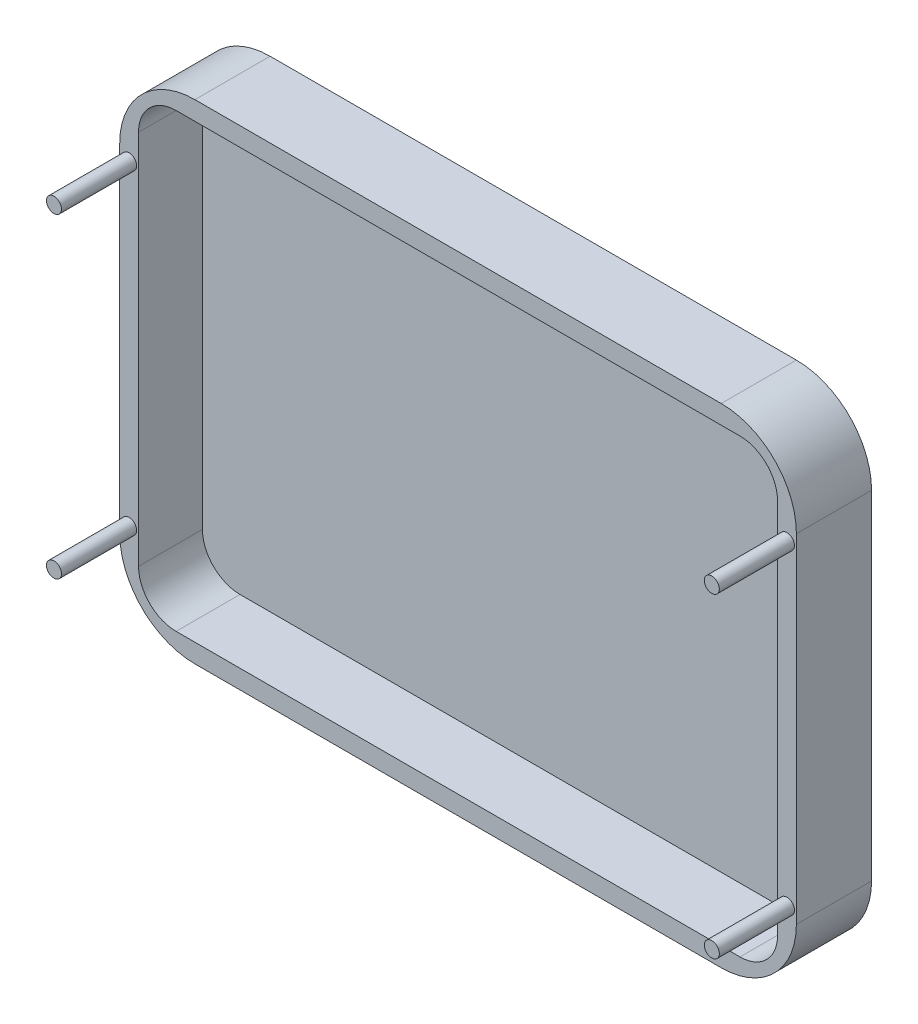
ISO-10303-21;
HEADER;
FILE_DESCRIPTION(('STEP AP214'),'2;1');
FILE_NAME('part.step','',(''),(''),'','','');
FILE_SCHEMA(('AUTOMOTIVE_DESIGN { 1 0 10303 214 1 1 1 1 }'));
ENDSEC;
DATA;
#1=APPLICATION_CONTEXT('core data for automotive mechanical design processes');
#2=APPLICATION_PROTOCOL_DEFINITION('international standard','automotive_design',2000,#1);
#3=PRODUCT_CONTEXT('',#1,'mechanical');
#4=PRODUCT('Part','Part','',(#3));
#5=PRODUCT_RELATED_PRODUCT_CATEGORY('part','',(#4));
#6=PRODUCT_DEFINITION_FORMATION('','',#4);
#7=PRODUCT_DEFINITION_CONTEXT('part definition',#1,'design');
#8=PRODUCT_DEFINITION('design','',#6,#7);
#9=PRODUCT_DEFINITION_SHAPE('','',#8);
#10=(LENGTH_UNIT() NAMED_UNIT(*) SI_UNIT(.MILLI.,.METRE.));
#11=(NAMED_UNIT(*) PLANE_ANGLE_UNIT() SI_UNIT($,.RADIAN.));
#12=(NAMED_UNIT(*) SI_UNIT($,.STERADIAN.) SOLID_ANGLE_UNIT());
#13=UNCERTAINTY_MEASURE_WITH_UNIT(LENGTH_MEASURE(1.E-05),#10,'distance_accuracy_value','');
#14=(GEOMETRIC_REPRESENTATION_CONTEXT(3) GLOBAL_UNCERTAINTY_ASSIGNED_CONTEXT((#13)) GLOBAL_UNIT_ASSIGNED_CONTEXT((#10,
#11,#12)) REPRESENTATION_CONTEXT('',''));
#15=CARTESIAN_POINT('',(0.,0.,0.));
#16=DIRECTION('',(0.,0.,1.));
#17=DIRECTION('',(1.,0.,0.));
#18=AXIS2_PLACEMENT_3D('',#15,#16,#17);
#19=CARTESIAN_POINT('',(75.0444444444444,41.2444444444444,20.));
#20=DIRECTION('',(0.,0.,-1.));
#21=DIRECTION('',(-1.,0.,0.));
#22=AXIS2_PLACEMENT_3D('',#19,#20,#21);
#23=CYLINDRICAL_SURFACE('',#22,20.);
#24=CARTESIAN_POINT('',(75.0444444444444,41.2444444444444,0.));
#25=DIRECTION('',(0.,0.,1.));
#26=DIRECTION('',(-1.,0.,0.));
#27=AXIS2_PLACEMENT_3D('',#24,#25,#26);
#28=CIRCLE('',#27,20.);
#29=CARTESIAN_POINT('',(95.0444444444444,41.2444444444443,0.));
#30=VERTEX_POINT('',#29);
#31=CARTESIAN_POINT('',(75.0444444444443,61.2444444444444,0.));
#32=VERTEX_POINT('',#31);
#33=EDGE_CURVE('E142',#30,#32,#28,.T.);
#34=ORIENTED_EDGE('',*,*,#33,.T.);
#35=DIRECTION('',(0.,0.,-1.));
#36=VECTOR('',#35,1.);
#37=CARTESIAN_POINT('',(75.0444444444443,61.2444444444444,20.));
#38=LINE('',#37,#36);
#39=CARTESIAN_POINT('',(75.0444444444443,61.2444444444444,20.));
#40=VERTEX_POINT('',#39);
#41=EDGE_CURVE('E171',#40,#32,#38,.T.);
#42=ORIENTED_EDGE('',*,*,#41,.F.);
#43=CARTESIAN_POINT('',(75.0444444444444,41.2444444444444,20.));
#44=DIRECTION('',(0.,0.,1.));
#45=DIRECTION('',(-1.,0.,0.));
#46=AXIS2_PLACEMENT_3D('',#43,#44,#45);
#47=CIRCLE('',#46,20.);
#48=CARTESIAN_POINT('',(95.0444444444444,41.2444444444443,20.));
#49=VERTEX_POINT('',#48);
#50=EDGE_CURVE('E158',#49,#40,#47,.T.);
#51=ORIENTED_EDGE('',*,*,#50,.F.);
#52=DIRECTION('',(0.,0.,-1.));
#53=VECTOR('',#52,1.);
#54=CARTESIAN_POINT('',(95.0444444444444,41.2444444444443,20.));
#55=LINE('',#54,#53);
#56=EDGE_CURVE('E138',#49,#30,#55,.T.);
#57=ORIENTED_EDGE('',*,*,#56,.T.);
#58=EDGE_LOOP('',(#34,#42,#51,#57));
#59=FACE_BOUND('',#58,.T.);
#60=ADVANCED_FACE('F33',(#59),#23,.T.);
#61=CARTESIAN_POINT('',(-64.9555555555555,61.2444444444444,20.));
#62=DIRECTION('',(0.,-1.,0.));
#63=DIRECTION('',(1.,0.,0.));
#64=AXIS2_PLACEMENT_3D('',#61,#62,#63);
#65=PLANE('',#64);
#66=DIRECTION('',(-1.,0.,0.));
#67=VECTOR('',#66,1.);
#68=CARTESIAN_POINT('',(-64.9555555555555,61.2444444444444,0.));
#69=LINE('',#68,#67);
#70=CARTESIAN_POINT('',(-64.9555555555555,61.2444444444444,0.));
#71=VERTEX_POINT('',#70);
#72=EDGE_CURVE('E145',#32,#71,#69,.T.);
#73=ORIENTED_EDGE('',*,*,#72,.T.);
#74=DIRECTION('',(0.,0.,-1.));
#75=VECTOR('',#74,1.);
#76=CARTESIAN_POINT('',(-64.9555555555555,61.2444444444444,20.));
#77=LINE('',#76,#75);
#78=CARTESIAN_POINT('',(-64.9555555555555,61.2444444444444,20.));
#79=VERTEX_POINT('',#78);
#80=EDGE_CURVE('E168',#79,#71,#77,.T.);
#81=ORIENTED_EDGE('',*,*,#80,.F.);
#82=DIRECTION('',(-1.,0.,0.));
#83=VECTOR('',#82,1.);
#84=CARTESIAN_POINT('',(-64.9555555555555,61.2444444444444,20.));
#85=LINE('',#84,#83);
#86=EDGE_CURVE('E98',#40,#79,#85,.T.);
#87=ORIENTED_EDGE('',*,*,#86,.F.);
#88=ORIENTED_EDGE('',*,*,#41,.T.);
#89=EDGE_LOOP('',(#73,#81,#87,#88));
#90=FACE_BOUND('',#89,.T.);
#91=ADVANCED_FACE('F268',(#90),#65,.F.);
#92=CARTESIAN_POINT('',(-64.9555555555556,41.2444444444445,20.));
#93=DIRECTION('',(0.,0.,-1.));
#94=DIRECTION('',(-1.,0.,0.));
#95=AXIS2_PLACEMENT_3D('',#92,#93,#94);
#96=CYLINDRICAL_SURFACE('',#95,20.);
#97=CARTESIAN_POINT('',(-64.9555555555556,41.2444444444445,0.));
#98=DIRECTION('',(0.,0.,1.));
#99=DIRECTION('',(1.,0.,0.));
#100=AXIS2_PLACEMENT_3D('',#97,#98,#99);
#101=CIRCLE('',#100,20.);
#102=CARTESIAN_POINT('',(-84.9555555555556,41.2444444444443,0.));
#103=VERTEX_POINT('',#102);
#104=EDGE_CURVE('E148',#71,#103,#101,.T.);
#105=ORIENTED_EDGE('',*,*,#104,.T.);
#106=DIRECTION('',(0.,0.,-1.));
#107=VECTOR('',#106,1.);
#108=CARTESIAN_POINT('',(-84.9555555555556,41.2444444444443,20.));
#109=LINE('',#108,#107);
#110=CARTESIAN_POINT('',(-84.9555555555556,41.2444444444443,20.));
#111=VERTEX_POINT('',#110);
#112=EDGE_CURVE('E165',#111,#103,#109,.T.);
#113=ORIENTED_EDGE('',*,*,#112,.F.);
#114=CARTESIAN_POINT('',(-64.9555555555556,41.2444444444445,20.));
#115=DIRECTION('',(0.,0.,1.));
#116=DIRECTION('',(1.,0.,0.));
#117=AXIS2_PLACEMENT_3D('',#114,#115,#116);
#118=CIRCLE('',#117,20.);
#119=EDGE_CURVE('E250',#79,#111,#118,.T.);
#120=ORIENTED_EDGE('',*,*,#119,.F.);
#121=ORIENTED_EDGE('',*,*,#80,.T.);
#122=EDGE_LOOP('',(#105,#113,#120,#121));
#123=FACE_BOUND('',#122,.T.);
#124=ADVANCED_FACE('F271',(#123),#96,.T.);
#125=CARTESIAN_POINT('',(-84.9555555555556,41.2444444444443,20.));
#126=DIRECTION('',(1.,0.,0.));
#127=DIRECTION('',(0.,1.,0.));
#128=AXIS2_PLACEMENT_3D('',#125,#126,#127);
#129=PLANE('',#128);
#130=DIRECTION('',(0.,-1.,0.));
#131=VECTOR('',#130,1.);
#132=CARTESIAN_POINT('',(-84.9555555555556,41.2444444444443,0.));
#133=LINE('',#132,#131);
#134=CARTESIAN_POINT('',(-84.9555555555556,-48.7555555555554,0.));
#135=VERTEX_POINT('',#134);
#136=EDGE_CURVE('E150',#103,#135,#133,.T.);
#137=ORIENTED_EDGE('',*,*,#136,.T.);
#138=DIRECTION('',(0.,0.,-1.));
#139=VECTOR('',#138,1.);
#140=CARTESIAN_POINT('',(-84.9555555555556,-48.7555555555554,20.));
#141=LINE('',#140,#139);
#142=CARTESIAN_POINT('',(-84.9555555555556,-48.7555555555554,20.));
#143=VERTEX_POINT('',#142);
#144=EDGE_CURVE('E162',#143,#135,#141,.T.);
#145=ORIENTED_EDGE('',*,*,#144,.F.);
#146=DIRECTION('',(0.,-1.,0.));
#147=VECTOR('',#146,1.);
#148=CARTESIAN_POINT('',(-84.9555555555556,41.2444444444443,20.));
#149=LINE('',#148,#147);
#150=EDGE_CURVE('E252',#111,#143,#149,.T.);
#151=ORIENTED_EDGE('',*,*,#150,.F.);
#152=ORIENTED_EDGE('',*,*,#112,.T.);
#153=EDGE_LOOP('',(#137,#145,#151,#152));
#154=FACE_BOUND('',#153,.T.);
#155=ADVANCED_FACE('F258',(#154),#129,.F.);
#156=CARTESIAN_POINT('',(-64.9555555555556,-48.7555555555556,20.));
#157=DIRECTION('',(0.,0.,-1.));
#158=DIRECTION('',(-1.,0.,0.));
#159=AXIS2_PLACEMENT_3D('',#156,#157,#158);
#160=CYLINDRICAL_SURFACE('',#159,20.);
#161=CARTESIAN_POINT('',(-64.9555555555556,-48.7555555555556,0.));
#162=DIRECTION('',(0.,0.,1.));
#163=DIRECTION('',(1.,0.,0.));
#164=AXIS2_PLACEMENT_3D('',#161,#162,#163);
#165=CIRCLE('',#164,20.);
#166=CARTESIAN_POINT('',(-64.9555555555555,-68.7555555555555,0.));
#167=VERTEX_POINT('',#166);
#168=EDGE_CURVE('E152',#135,#167,#165,.T.);
#169=ORIENTED_EDGE('',*,*,#168,.T.);
#170=DIRECTION('',(0.,0.,-1.));
#171=VECTOR('',#170,1.);
#172=CARTESIAN_POINT('',(-64.9555555555555,-68.7555555555555,20.));
#173=LINE('',#172,#171);
#174=CARTESIAN_POINT('',(-64.9555555555555,-68.7555555555555,20.));
#175=VERTEX_POINT('',#174);
#176=EDGE_CURVE('E133',#175,#167,#173,.T.);
#177=ORIENTED_EDGE('',*,*,#176,.F.);
#178=CARTESIAN_POINT('',(-64.9555555555556,-48.7555555555556,20.));
#179=DIRECTION('',(0.,0.,1.));
#180=DIRECTION('',(1.,0.,0.));
#181=AXIS2_PLACEMENT_3D('',#178,#179,#180);
#182=CIRCLE('',#181,20.);
#183=EDGE_CURVE('E121',#143,#175,#182,.T.);
#184=ORIENTED_EDGE('',*,*,#183,.F.);
#185=ORIENTED_EDGE('',*,*,#144,.T.);
#186=EDGE_LOOP('',(#169,#177,#184,#185));
#187=FACE_BOUND('',#186,.T.);
#188=ADVANCED_FACE('F262',(#187),#160,.T.);
#189=CARTESIAN_POINT('',(-64.9555555555554,-68.7555555555556,20.));
#190=DIRECTION('',(0.,1.,0.));
#191=DIRECTION('',(0.,0.,1.));
#192=AXIS2_PLACEMENT_3D('',#189,#190,#191);
#193=PLANE('',#192);
#194=DIRECTION('',(1.,0.,0.));
#195=VECTOR('',#194,1.);
#196=CARTESIAN_POINT('',(-64.9555555555554,-68.7555555555556,0.));
#197=LINE('',#196,#195);
#198=CARTESIAN_POINT('',(75.0444444444443,-68.7555555555556,0.));
#199=VERTEX_POINT('',#198);
#200=EDGE_CURVE('E130',#167,#199,#197,.T.);
#201=ORIENTED_EDGE('',*,*,#200,.T.);
#202=DIRECTION('',(0.,0.,-1.));
#203=VECTOR('',#202,1.);
#204=CARTESIAN_POINT('',(75.0444444444443,-68.7555555555556,20.));
#205=LINE('',#204,#203);
#206=CARTESIAN_POINT('',(75.0444444444443,-68.7555555555556,20.));
#207=VERTEX_POINT('',#206);
#208=EDGE_CURVE('E127',#207,#199,#205,.T.);
#209=ORIENTED_EDGE('',*,*,#208,.F.);
#210=DIRECTION('',(1.,0.,0.));
#211=VECTOR('',#210,1.);
#212=CARTESIAN_POINT('',(-64.9555555555554,-68.7555555555556,20.));
#213=LINE('',#212,#211);
#214=EDGE_CURVE('E114',#175,#207,#213,.T.);
#215=ORIENTED_EDGE('',*,*,#214,.F.);
#216=ORIENTED_EDGE('',*,*,#176,.T.);
#217=EDGE_LOOP('',(#201,#209,#215,#216));
#218=FACE_BOUND('',#217,.T.);
#219=ADVANCED_FACE('F128',(#218),#193,.F.);
#220=CARTESIAN_POINT('',(75.0444444444444,-48.7555555555556,20.));
#221=DIRECTION('',(0.,0.,-1.));
#222=DIRECTION('',(-1.,0.,0.));
#223=AXIS2_PLACEMENT_3D('',#220,#221,#222);
#224=CYLINDRICAL_SURFACE('',#223,20.);
#225=CARTESIAN_POINT('',(75.0444444444444,-48.7555555555556,0.));
#226=DIRECTION('',(0.,0.,1.));
#227=DIRECTION('',(1.,0.,0.));
#228=AXIS2_PLACEMENT_3D('',#225,#226,#227);
#229=CIRCLE('',#228,20.);
#230=CARTESIAN_POINT('',(95.0444444444444,-48.7555555555556,0.));
#231=VERTEX_POINT('',#230);
#232=EDGE_CURVE('E155',#199,#231,#229,.T.);
#233=ORIENTED_EDGE('',*,*,#232,.T.);
#234=DIRECTION('',(0.,0.,-1.));
#235=VECTOR('',#234,1.);
#236=CARTESIAN_POINT('',(95.0444444444444,-48.7555555555556,20.));
#237=LINE('',#236,#235);
#238=CARTESIAN_POINT('',(95.0444444444444,-48.7555555555556,20.));
#239=VERTEX_POINT('',#238);
#240=EDGE_CURVE('E134',#239,#231,#237,.T.);
#241=ORIENTED_EDGE('',*,*,#240,.F.);
#242=CARTESIAN_POINT('',(75.0444444444444,-48.7555555555556,20.));
#243=DIRECTION('',(0.,0.,1.));
#244=DIRECTION('',(1.,0.,0.));
#245=AXIS2_PLACEMENT_3D('',#242,#243,#244);
#246=CIRCLE('',#245,20.);
#247=EDGE_CURVE('E118',#207,#239,#246,.T.);
#248=ORIENTED_EDGE('',*,*,#247,.F.);
#249=ORIENTED_EDGE('',*,*,#208,.T.);
#250=EDGE_LOOP('',(#233,#241,#248,#249));
#251=FACE_BOUND('',#250,.T.);
#252=ADVANCED_FACE('F136',(#251),#224,.T.);
#253=CARTESIAN_POINT('',(95.0444444444444,41.2444444444443,20.));
#254=DIRECTION('',(-1.,0.,0.));
#255=DIRECTION('',(0.,0.,1.));
#256=AXIS2_PLACEMENT_3D('',#253,#254,#255);
#257=PLANE('',#256);
#258=DIRECTION('',(0.,1.,0.));
#259=VECTOR('',#258,1.);
#260=CARTESIAN_POINT('',(95.0444444444444,41.2444444444443,0.));
#261=LINE('',#260,#259);
#262=EDGE_CURVE('E89',#231,#30,#261,.T.);
#263=ORIENTED_EDGE('',*,*,#262,.T.);
#264=ORIENTED_EDGE('',*,*,#56,.F.);
#265=DIRECTION('',(0.,1.,0.));
#266=VECTOR('',#265,1.);
#267=CARTESIAN_POINT('',(95.0444444444444,41.2444444444443,20.));
#268=LINE('',#267,#266);
#269=EDGE_CURVE('E56',#239,#49,#268,.T.);
#270=ORIENTED_EDGE('',*,*,#269,.F.);
#271=ORIENTED_EDGE('',*,*,#240,.T.);
#272=EDGE_LOOP('',(#263,#264,#270,#271));
#273=FACE_BOUND('',#272,.T.);
#274=ADVANCED_FACE('F186',(#273),#257,.F.);
#275=CARTESIAN_POINT('',(75.0444444444444,41.2444444444444,20.));
#276=DIRECTION('',(0.,0.,-1.));
#277=DIRECTION('',(-1.,0.,0.));
#278=AXIS2_PLACEMENT_3D('',#275,#276,#277);
#279=PLANE('',#278);
#280=CARTESIAN_POINT('',(92.5444444444444,38.2444444444444,20.));
#281=DIRECTION('',(0.,0.,-1.));
#282=DIRECTION('',(-1.,0.,0.));
#283=AXIS2_PLACEMENT_3D('',#280,#281,#282);
#284=CIRCLE('',#283,2.);
#285=CARTESIAN_POINT('',(90.5444444444444,38.2444444444444,20.));
#286=VERTEX_POINT('',#285);
#287=EDGE_CURVE('E11',#286,#286,#284,.F.);
#288=ORIENTED_EDGE('',*,*,#287,.F.);
#289=EDGE_LOOP('',(#288));
#290=FACE_BOUND('',#289,.T.);
#291=CARTESIAN_POINT('',(92.5444444444444,-45.7555555555555,20.));
#292=DIRECTION('',(0.,0.,-1.));
#293=DIRECTION('',(-1.,0.,0.));
#294=AXIS2_PLACEMENT_3D('',#291,#292,#293);
#295=CIRCLE('',#294,2.);
#296=CARTESIAN_POINT('',(90.5444444444444,-45.7555555555555,20.));
#297=VERTEX_POINT('',#296);
#298=EDGE_CURVE('E40',#297,#297,#295,.F.);
#299=ORIENTED_EDGE('',*,*,#298,.F.);
#300=EDGE_LOOP('',(#299));
#301=FACE_BOUND('',#300,.T.);
#302=CARTESIAN_POINT('',(-82.4555555555556,-45.7555555555555,20.));
#303=DIRECTION('',(0.,0.,-1.));
#304=DIRECTION('',(-1.,0.,0.));
#305=AXIS2_PLACEMENT_3D('',#302,#303,#304);
#306=CIRCLE('',#305,2.);
#307=CARTESIAN_POINT('',(-84.4555555555556,-45.7555555555555,20.));
#308=VERTEX_POINT('',#307);
#309=EDGE_CURVE('E176',#308,#308,#306,.F.);
#310=ORIENTED_EDGE('',*,*,#309,.F.);
#311=EDGE_LOOP('',(#310));
#312=FACE_BOUND('',#311,.T.);
#313=CARTESIAN_POINT('',(-82.4555555555556,38.2444444444444,20.));
#314=DIRECTION('',(0.,0.,-1.));
#315=DIRECTION('',(-1.,0.,0.));
#316=AXIS2_PLACEMENT_3D('',#313,#314,#315);
#317=CIRCLE('',#316,2.);
#318=CARTESIAN_POINT('',(-84.4555555555556,38.2444444444444,20.));
#319=VERTEX_POINT('',#318);
#320=EDGE_CURVE('E173',#319,#319,#317,.F.);
#321=ORIENTED_EDGE('',*,*,#320,.F.);
#322=EDGE_LOOP('',(#321));
#323=FACE_BOUND('',#322,.T.);
#324=DIRECTION('',(-1.,0.,0.));
#325=VECTOR('',#324,1.);
#326=CARTESIAN_POINT('',(-69.9555555555556,56.2444444444445,20.));
#327=LINE('',#326,#325);
#328=CARTESIAN_POINT('',(80.0444444444444,56.2444444444445,20.));
#329=VERTEX_POINT('',#328);
#330=CARTESIAN_POINT('',(-69.9555555555556,56.2444444444445,20.));
#331=VERTEX_POINT('',#330);
#332=EDGE_CURVE('E196',#329,#331,#327,.T.);
#333=ORIENTED_EDGE('',*,*,#332,.F.);
#334=CARTESIAN_POINT('',(80.0444444444444,46.2444444444445,20.));
#335=DIRECTION('',(0.,0.,1.));
#336=DIRECTION('',(-1.,0.,0.));
#337=AXIS2_PLACEMENT_3D('',#334,#335,#336);
#338=CIRCLE('',#337,9.99999999999999);
#339=CARTESIAN_POINT('',(90.0444444444444,46.2444444444445,20.));
#340=VERTEX_POINT('',#339);
#341=EDGE_CURVE('E47',#340,#329,#338,.T.);
#342=ORIENTED_EDGE('',*,*,#341,.F.);
#343=DIRECTION('',(0.,1.,0.));
#344=VECTOR('',#343,1.);
#345=CARTESIAN_POINT('',(90.0444444444444,46.2444444444445,20.));
#346=LINE('',#345,#344);
#347=CARTESIAN_POINT('',(90.0444444444444,-53.7555555555555,20.));
#348=VERTEX_POINT('',#347);
#349=EDGE_CURVE('E222',#348,#340,#346,.T.);
#350=ORIENTED_EDGE('',*,*,#349,.F.);
#351=CARTESIAN_POINT('',(80.0444444444444,-53.7555555555555,20.));
#352=DIRECTION('',(0.,0.,1.));
#353=DIRECTION('',(1.,0.,0.));
#354=AXIS2_PLACEMENT_3D('',#351,#352,#353);
#355=CIRCLE('',#354,10.);
#356=CARTESIAN_POINT('',(80.0444444444444,-63.7555555555555,20.));
#357=VERTEX_POINT('',#356);
#358=EDGE_CURVE('E219',#357,#348,#355,.T.);
#359=ORIENTED_EDGE('',*,*,#358,.F.);
#360=DIRECTION('',(1.,0.,0.));
#361=VECTOR('',#360,1.);
#362=CARTESIAN_POINT('',(-69.9555555555556,-63.7555555555555,20.));
#363=LINE('',#362,#361);
#364=CARTESIAN_POINT('',(-69.9555555555556,-63.7555555555555,20.));
#365=VERTEX_POINT('',#364);
#366=EDGE_CURVE('E216',#365,#357,#363,.T.);
#367=ORIENTED_EDGE('',*,*,#366,.F.);
#368=CARTESIAN_POINT('',(-69.9555555555556,-53.7555555555555,20.));
#369=DIRECTION('',(0.,0.,1.));
#370=DIRECTION('',(1.,0.,0.));
#371=AXIS2_PLACEMENT_3D('',#368,#369,#370);
#372=CIRCLE('',#371,10.);
#373=CARTESIAN_POINT('',(-79.9555555555556,-53.7555555555555,20.));
#374=VERTEX_POINT('',#373);
#375=EDGE_CURVE('E213',#374,#365,#372,.T.);
#376=ORIENTED_EDGE('',*,*,#375,.F.);
#377=DIRECTION('',(0.,-1.,0.));
#378=VECTOR('',#377,1.);
#379=CARTESIAN_POINT('',(-79.9555555555556,46.2444444444445,20.));
#380=LINE('',#379,#378);
#381=CARTESIAN_POINT('',(-79.9555555555556,46.2444444444445,20.));
#382=VERTEX_POINT('',#381);
#383=EDGE_CURVE('E205',#382,#374,#380,.T.);
#384=ORIENTED_EDGE('',*,*,#383,.F.);
#385=CARTESIAN_POINT('',(-69.9555555555556,46.2444444444445,20.));
#386=DIRECTION('',(0.,0.,1.));
#387=DIRECTION('',(1.,0.,0.));
#388=AXIS2_PLACEMENT_3D('',#385,#386,#387);
#389=CIRCLE('',#388,10.);
#390=EDGE_CURVE('E201',#331,#382,#389,.T.);
#391=ORIENTED_EDGE('',*,*,#390,.F.);
#392=EDGE_LOOP('',(#333,#342,#350,#359,#367,#376,#384,#391));
#393=FACE_BOUND('',#392,.T.);
#394=ORIENTED_EDGE('',*,*,#50,.T.);
#395=ORIENTED_EDGE('',*,*,#86,.T.);
#396=ORIENTED_EDGE('',*,*,#119,.T.);
#397=ORIENTED_EDGE('',*,*,#150,.T.);
#398=ORIENTED_EDGE('',*,*,#183,.T.);
#399=ORIENTED_EDGE('',*,*,#214,.T.);
#400=ORIENTED_EDGE('',*,*,#247,.T.);
#401=ORIENTED_EDGE('',*,*,#269,.T.);
#402=EDGE_LOOP('',(#394,#395,#396,#397,#398,#399,#400,#401));
#403=FACE_BOUND('',#402,.T.);
#404=ADVANCED_FACE('F116',(#290,#301,#312,#323,#393,#403),#279,.F.);
#405=CARTESIAN_POINT('',(75.0444444444444,41.2444444444444,0.));
#406=DIRECTION('',(0.,0.,-1.));
#407=DIRECTION('',(-1.,0.,0.));
#408=AXIS2_PLACEMENT_3D('',#405,#406,#407);
#409=PLANE('',#408);
#410=ORIENTED_EDGE('',*,*,#33,.F.);
#411=ORIENTED_EDGE('',*,*,#262,.F.);
#412=ORIENTED_EDGE('',*,*,#232,.F.);
#413=ORIENTED_EDGE('',*,*,#200,.F.);
#414=ORIENTED_EDGE('',*,*,#168,.F.);
#415=ORIENTED_EDGE('',*,*,#136,.F.);
#416=ORIENTED_EDGE('',*,*,#104,.F.);
#417=ORIENTED_EDGE('',*,*,#72,.F.);
#418=EDGE_LOOP('',(#410,#411,#412,#413,#414,#415,#416,#417));
#419=FACE_BOUND('',#418,.T.);
#420=ADVANCED_FACE('F185',(#419),#409,.T.);
#421=CARTESIAN_POINT('',(80.0444444444444,46.2444444444445,3.));
#422=DIRECTION('',(0.,0.,1.));
#423=DIRECTION('',(1.,0.,0.));
#424=AXIS2_PLACEMENT_3D('',#421,#422,#423);
#425=CYLINDRICAL_SURFACE('',#424,9.99999999999999);
#426=ORIENTED_EDGE('',*,*,#341,.T.);
#427=DIRECTION('',(0.,0.,1.));
#428=VECTOR('',#427,1.);
#429=CARTESIAN_POINT('',(80.0444444444444,56.2444444444445,3.));
#430=LINE('',#429,#428);
#431=CARTESIAN_POINT('',(80.0444444444444,56.2444444444445,3.));
#432=VERTEX_POINT('',#431);
#433=EDGE_CURVE('E245',#432,#329,#430,.T.);
#434=ORIENTED_EDGE('',*,*,#433,.F.);
#435=CARTESIAN_POINT('',(80.0444444444444,46.2444444444445,3.));
#436=DIRECTION('',(0.,0.,1.));
#437=DIRECTION('',(-1.,0.,0.));
#438=AXIS2_PLACEMENT_3D('',#435,#436,#437);
#439=CIRCLE('',#438,9.99999999999999);
#440=CARTESIAN_POINT('',(90.0444444444444,46.2444444444445,3.));
#441=VERTEX_POINT('',#440);
#442=EDGE_CURVE('E225',#441,#432,#439,.T.);
#443=ORIENTED_EDGE('',*,*,#442,.F.);
#444=DIRECTION('',(0.,0.,1.));
#445=VECTOR('',#444,1.);
#446=CARTESIAN_POINT('',(90.0444444444444,46.2444444444445,3.));
#447=LINE('',#446,#445);
#448=EDGE_CURVE('E146',#441,#340,#447,.T.);
#449=ORIENTED_EDGE('',*,*,#448,.T.);
#450=EDGE_LOOP('',(#426,#434,#443,#449));
#451=FACE_BOUND('',#450,.T.);
#452=ADVANCED_FACE('F338',(#451),#425,.F.);
#453=CARTESIAN_POINT('',(90.0444444444444,46.2444444444445,3.));
#454=DIRECTION('',(1.,0.,0.));
#455=DIRECTION('',(0.,0.,-1.));
#456=AXIS2_PLACEMENT_3D('',#453,#454,#455);
#457=PLANE('',#456);
#458=ORIENTED_EDGE('',*,*,#349,.T.);
#459=ORIENTED_EDGE('',*,*,#448,.F.);
#460=DIRECTION('',(0.,1.,0.));
#461=VECTOR('',#460,1.);
#462=CARTESIAN_POINT('',(90.0444444444444,46.2444444444445,3.));
#463=LINE('',#462,#461);
#464=CARTESIAN_POINT('',(90.0444444444444,-53.7555555555555,3.));
#465=VERTEX_POINT('',#464);
#466=EDGE_CURVE('E247',#465,#441,#463,.T.);
#467=ORIENTED_EDGE('',*,*,#466,.F.);
#468=DIRECTION('',(0.,0.,1.));
#469=VECTOR('',#468,1.);
#470=CARTESIAN_POINT('',(90.0444444444444,-53.7555555555555,3.));
#471=LINE('',#470,#469);
#472=EDGE_CURVE('E227',#465,#348,#471,.T.);
#473=ORIENTED_EDGE('',*,*,#472,.T.);
#474=EDGE_LOOP('',(#458,#459,#467,#473));
#475=FACE_BOUND('',#474,.T.);
#476=ADVANCED_FACE('F347',(#475),#457,.F.);
#477=CARTESIAN_POINT('',(80.0444444444444,-53.7555555555555,3.));
#478=DIRECTION('',(0.,0.,1.));
#479=DIRECTION('',(1.,0.,0.));
#480=AXIS2_PLACEMENT_3D('',#477,#478,#479);
#481=CYLINDRICAL_SURFACE('',#480,10.);
#482=ORIENTED_EDGE('',*,*,#358,.T.);
#483=ORIENTED_EDGE('',*,*,#472,.F.);
#484=CARTESIAN_POINT('',(80.0444444444444,-53.7555555555555,3.));
#485=DIRECTION('',(0.,0.,1.));
#486=DIRECTION('',(1.,0.,0.));
#487=AXIS2_PLACEMENT_3D('',#484,#485,#486);
#488=CIRCLE('',#487,10.);
#489=CARTESIAN_POINT('',(80.0444444444444,-63.7555555555555,3.));
#490=VERTEX_POINT('',#489);
#491=EDGE_CURVE('E543',#490,#465,#488,.T.);
#492=ORIENTED_EDGE('',*,*,#491,.F.);
#493=DIRECTION('',(0.,0.,1.));
#494=VECTOR('',#493,1.);
#495=CARTESIAN_POINT('',(80.0444444444444,-63.7555555555555,3.));
#496=LINE('',#495,#494);
#497=EDGE_CURVE('E230',#490,#357,#496,.T.);
#498=ORIENTED_EDGE('',*,*,#497,.T.);
#499=EDGE_LOOP('',(#482,#483,#492,#498));
#500=FACE_BOUND('',#499,.T.);
#501=ADVANCED_FACE('F356',(#500),#481,.F.);
#502=CARTESIAN_POINT('',(-69.9555555555556,-63.7555555555555,3.));
#503=DIRECTION('',(0.,-1.,0.));
#504=DIRECTION('',(0.,0.,-1.));
#505=AXIS2_PLACEMENT_3D('',#502,#503,#504);
#506=PLANE('',#505);
#507=ORIENTED_EDGE('',*,*,#366,.T.);
#508=ORIENTED_EDGE('',*,*,#497,.F.);
#509=DIRECTION('',(1.,0.,0.));
#510=VECTOR('',#509,1.);
#511=CARTESIAN_POINT('',(-69.9555555555556,-63.7555555555555,3.));
#512=LINE('',#511,#510);
#513=CARTESIAN_POINT('',(-69.9555555555556,-63.7555555555555,3.));
#514=VERTEX_POINT('',#513);
#515=EDGE_CURVE('E540',#514,#490,#512,.T.);
#516=ORIENTED_EDGE('',*,*,#515,.F.);
#517=DIRECTION('',(0.,0.,1.));
#518=VECTOR('',#517,1.);
#519=CARTESIAN_POINT('',(-69.9555555555556,-63.7555555555555,3.));
#520=LINE('',#519,#518);
#521=EDGE_CURVE('E233',#514,#365,#520,.T.);
#522=ORIENTED_EDGE('',*,*,#521,.T.);
#523=EDGE_LOOP('',(#507,#508,#516,#522));
#524=FACE_BOUND('',#523,.T.);
#525=ADVANCED_FACE('F366',(#524),#506,.F.);
#526=CARTESIAN_POINT('',(-69.9555555555556,-53.7555555555555,3.));
#527=DIRECTION('',(0.,0.,1.));
#528=DIRECTION('',(1.,0.,0.));
#529=AXIS2_PLACEMENT_3D('',#526,#527,#528);
#530=CYLINDRICAL_SURFACE('',#529,10.);
#531=ORIENTED_EDGE('',*,*,#375,.T.);
#532=ORIENTED_EDGE('',*,*,#521,.F.);
#533=CARTESIAN_POINT('',(-69.9555555555556,-53.7555555555555,3.));
#534=DIRECTION('',(0.,0.,1.));
#535=DIRECTION('',(1.,0.,0.));
#536=AXIS2_PLACEMENT_3D('',#533,#534,#535);
#537=CIRCLE('',#536,10.);
#538=CARTESIAN_POINT('',(-79.9555555555556,-53.7555555555555,3.));
#539=VERTEX_POINT('',#538);
#540=EDGE_CURVE('E537',#539,#514,#537,.T.);
#541=ORIENTED_EDGE('',*,*,#540,.F.);
#542=DIRECTION('',(0.,0.,1.));
#543=VECTOR('',#542,1.);
#544=CARTESIAN_POINT('',(-79.9555555555556,-53.7555555555555,3.));
#545=LINE('',#544,#543);
#546=EDGE_CURVE('E236',#539,#374,#545,.T.);
#547=ORIENTED_EDGE('',*,*,#546,.T.);
#548=EDGE_LOOP('',(#531,#532,#541,#547));
#549=FACE_BOUND('',#548,.T.);
#550=ADVANCED_FACE('F376',(#549),#530,.F.);
#551=CARTESIAN_POINT('',(-79.9555555555556,46.2444444444445,3.));
#552=DIRECTION('',(-1.,0.,0.));
#553=DIRECTION('',(0.,-1.,0.));
#554=AXIS2_PLACEMENT_3D('',#551,#552,#553);
#555=PLANE('',#554);
#556=ORIENTED_EDGE('',*,*,#383,.T.);
#557=ORIENTED_EDGE('',*,*,#546,.F.);
#558=DIRECTION('',(0.,-1.,0.));
#559=VECTOR('',#558,1.);
#560=CARTESIAN_POINT('',(-79.9555555555556,46.2444444444445,3.));
#561=LINE('',#560,#559);
#562=CARTESIAN_POINT('',(-79.9555555555556,46.2444444444445,3.));
#563=VERTEX_POINT('',#562);
#564=EDGE_CURVE('E534',#563,#539,#561,.T.);
#565=ORIENTED_EDGE('',*,*,#564,.F.);
#566=DIRECTION('',(0.,0.,1.));
#567=VECTOR('',#566,1.);
#568=CARTESIAN_POINT('',(-79.9555555555556,46.2444444444445,3.));
#569=LINE('',#568,#567);
#570=EDGE_CURVE('E239',#563,#382,#569,.T.);
#571=ORIENTED_EDGE('',*,*,#570,.T.);
#572=EDGE_LOOP('',(#556,#557,#565,#571));
#573=FACE_BOUND('',#572,.T.);
#574=ADVANCED_FACE('F386',(#573),#555,.F.);
#575=CARTESIAN_POINT('',(-69.9555555555556,46.2444444444445,3.));
#576=DIRECTION('',(0.,0.,1.));
#577=DIRECTION('',(1.,0.,0.));
#578=AXIS2_PLACEMENT_3D('',#575,#576,#577);
#579=CYLINDRICAL_SURFACE('',#578,10.);
#580=ORIENTED_EDGE('',*,*,#390,.T.);
#581=ORIENTED_EDGE('',*,*,#570,.F.);
#582=CARTESIAN_POINT('',(-69.9555555555556,46.2444444444445,3.));
#583=DIRECTION('',(0.,0.,1.));
#584=DIRECTION('',(1.,0.,0.));
#585=AXIS2_PLACEMENT_3D('',#582,#583,#584);
#586=CIRCLE('',#585,10.);
#587=CARTESIAN_POINT('',(-69.9555555555556,56.2444444444445,3.));
#588=VERTEX_POINT('',#587);
#589=EDGE_CURVE('E531',#588,#563,#586,.T.);
#590=ORIENTED_EDGE('',*,*,#589,.F.);
#591=DIRECTION('',(0.,0.,1.));
#592=VECTOR('',#591,1.);
#593=CARTESIAN_POINT('',(-69.9555555555556,56.2444444444445,3.));
#594=LINE('',#593,#592);
#595=EDGE_CURVE('E242',#588,#331,#594,.T.);
#596=ORIENTED_EDGE('',*,*,#595,.T.);
#597=EDGE_LOOP('',(#580,#581,#590,#596));
#598=FACE_BOUND('',#597,.T.);
#599=ADVANCED_FACE('F396',(#598),#579,.F.);
#600=CARTESIAN_POINT('',(-69.9555555555556,56.2444444444445,3.));
#601=DIRECTION('',(0.,1.,0.));
#602=DIRECTION('',(-1.,0.,0.));
#603=AXIS2_PLACEMENT_3D('',#600,#601,#602);
#604=PLANE('',#603);
#605=ORIENTED_EDGE('',*,*,#332,.T.);
#606=ORIENTED_EDGE('',*,*,#595,.F.);
#607=DIRECTION('',(-1.,0.,0.));
#608=VECTOR('',#607,1.);
#609=CARTESIAN_POINT('',(-69.9555555555556,56.2444444444445,3.));
#610=LINE('',#609,#608);
#611=EDGE_CURVE('E528',#432,#588,#610,.T.);
#612=ORIENTED_EDGE('',*,*,#611,.F.);
#613=ORIENTED_EDGE('',*,*,#433,.T.);
#614=EDGE_LOOP('',(#605,#606,#612,#613));
#615=FACE_BOUND('',#614,.T.);
#616=ADVANCED_FACE('F406',(#615),#604,.F.);
#617=CARTESIAN_POINT('',(80.0444444444444,46.2444444444445,3.));
#618=DIRECTION('',(0.,0.,-1.));
#619=DIRECTION('',(-1.,0.,0.));
#620=AXIS2_PLACEMENT_3D('',#617,#618,#619);
#621=PLANE('',#620);
#622=ORIENTED_EDGE('',*,*,#442,.T.);
#623=ORIENTED_EDGE('',*,*,#611,.T.);
#624=ORIENTED_EDGE('',*,*,#589,.T.);
#625=ORIENTED_EDGE('',*,*,#564,.T.);
#626=ORIENTED_EDGE('',*,*,#540,.T.);
#627=ORIENTED_EDGE('',*,*,#515,.T.);
#628=ORIENTED_EDGE('',*,*,#491,.T.);
#629=ORIENTED_EDGE('',*,*,#466,.T.);
#630=EDGE_LOOP('',(#622,#623,#624,#625,#626,#627,#628,#629));
#631=FACE_BOUND('',#630,.T.);
#632=ADVANCED_FACE('F416',(#631),#621,.F.);
#633=CARTESIAN_POINT('',(-82.4555555555556,38.2444444444444,40.));
#634=DIRECTION('',(0.,0.,-1.));
#635=DIRECTION('',(-1.,0.,0.));
#636=AXIS2_PLACEMENT_3D('',#633,#634,#635);
#637=CYLINDRICAL_SURFACE('',#636,2.);
#638=CARTESIAN_POINT('',(-82.4555555555556,38.2444444444444,40.));
#639=DIRECTION('',(0.,0.,1.));
#640=DIRECTION('',(1.,0.,0.));
#641=AXIS2_PLACEMENT_3D('',#638,#639,#640);
#642=CIRCLE('',#641,2.);
#643=CARTESIAN_POINT('',(-80.4555555555556,38.2444444444444,40.));
#644=VERTEX_POINT('',#643);
#645=EDGE_CURVE('E207',#644,#644,#642,.T.);
#646=ORIENTED_EDGE('',*,*,#645,.F.);
#647=EDGE_LOOP('',(#646));
#648=FACE_BOUND('',#647,.T.);
#649=ORIENTED_EDGE('',*,*,#320,.T.);
#650=EDGE_LOOP('',(#649));
#651=FACE_BOUND('',#650,.T.);
#652=ADVANCED_FACE('F425',(#648,#651),#637,.T.);
#653=CARTESIAN_POINT('',(-82.4555555555556,38.2444444444444,40.));
#654=DIRECTION('',(0.,0.,1.));
#655=DIRECTION('',(1.,0.,0.));
#656=AXIS2_PLACEMENT_3D('',#653,#654,#655);
#657=PLANE('',#656);
#658=ORIENTED_EDGE('',*,*,#645,.T.);
#659=EDGE_LOOP('',(#658));
#660=FACE_BOUND('',#659,.T.);
#661=ADVANCED_FACE('F440',(#660),#657,.T.);
#662=CARTESIAN_POINT('',(-82.4555555555556,-45.7555555555555,40.));
#663=DIRECTION('',(0.,0.,-1.));
#664=DIRECTION('',(-1.,0.,0.));
#665=AXIS2_PLACEMENT_3D('',#662,#663,#664);
#666=CYLINDRICAL_SURFACE('',#665,2.);
#667=CARTESIAN_POINT('',(-82.4555555555556,-45.7555555555555,40.));
#668=DIRECTION('',(0.,0.,1.));
#669=DIRECTION('',(1.,0.,0.));
#670=AXIS2_PLACEMENT_3D('',#667,#668,#669);
#671=CIRCLE('',#670,2.);
#672=CARTESIAN_POINT('',(-80.4555555555556,-45.7555555555555,40.));
#673=VERTEX_POINT('',#672);
#674=EDGE_CURVE('E519',#673,#673,#671,.T.);
#675=ORIENTED_EDGE('',*,*,#674,.F.);
#676=EDGE_LOOP('',(#675));
#677=FACE_BOUND('',#676,.T.);
#678=ORIENTED_EDGE('',*,*,#309,.T.);
#679=EDGE_LOOP('',(#678));
#680=FACE_BOUND('',#679,.T.);
#681=ADVANCED_FACE('F450',(#677,#680),#666,.T.);
#682=CARTESIAN_POINT('',(-82.4555555555556,-45.7555555555555,40.));
#683=DIRECTION('',(0.,0.,1.));
#684=DIRECTION('',(1.,0.,0.));
#685=AXIS2_PLACEMENT_3D('',#682,#683,#684);
#686=PLANE('',#685);
#687=ORIENTED_EDGE('',*,*,#674,.T.);
#688=EDGE_LOOP('',(#687));
#689=FACE_BOUND('',#688,.T.);
#690=ADVANCED_FACE('F460',(#689),#686,.T.);
#691=CARTESIAN_POINT('',(92.5444444444444,-45.7555555555555,40.));
#692=DIRECTION('',(0.,0.,-1.));
#693=DIRECTION('',(-1.,0.,0.));
#694=AXIS2_PLACEMENT_3D('',#691,#692,#693);
#695=CYLINDRICAL_SURFACE('',#694,2.);
#696=CARTESIAN_POINT('',(92.5444444444444,-45.7555555555555,40.));
#697=DIRECTION('',(0.,0.,1.));
#698=DIRECTION('',(1.,0.,0.));
#699=AXIS2_PLACEMENT_3D('',#696,#697,#698);
#700=CIRCLE('',#699,2.);
#701=CARTESIAN_POINT('',(94.5444444444444,-45.7555555555555,40.));
#702=VERTEX_POINT('',#701);
#703=EDGE_CURVE('E516',#702,#702,#700,.T.);
#704=ORIENTED_EDGE('',*,*,#703,.F.);
#705=EDGE_LOOP('',(#704));
#706=FACE_BOUND('',#705,.T.);
#707=ORIENTED_EDGE('',*,*,#298,.T.);
#708=EDGE_LOOP('',(#707));
#709=FACE_BOUND('',#708,.T.);
#710=ADVANCED_FACE('F181',(#706,#709),#695,.T.);
#711=CARTESIAN_POINT('',(92.5444444444444,-45.7555555555555,40.));
#712=DIRECTION('',(0.,0.,1.));
#713=DIRECTION('',(1.,0.,0.));
#714=AXIS2_PLACEMENT_3D('',#711,#712,#713);
#715=PLANE('',#714);
#716=ORIENTED_EDGE('',*,*,#703,.T.);
#717=EDGE_LOOP('',(#716));
#718=FACE_BOUND('',#717,.T.);
#719=ADVANCED_FACE('F479',(#718),#715,.T.);
#720=CARTESIAN_POINT('',(92.5444444444444,38.2444444444444,40.));
#721=DIRECTION('',(0.,0.,-1.));
#722=DIRECTION('',(-1.,0.,0.));
#723=AXIS2_PLACEMENT_3D('',#720,#721,#722);
#724=CYLINDRICAL_SURFACE('',#723,2.);
#725=CARTESIAN_POINT('',(92.5444444444444,38.2444444444444,40.));
#726=DIRECTION('',(0.,0.,1.));
#727=DIRECTION('',(1.,0.,0.));
#728=AXIS2_PLACEMENT_3D('',#725,#726,#727);
#729=CIRCLE('',#728,2.);
#730=CARTESIAN_POINT('',(94.5444444444444,38.2444444444444,40.));
#731=VERTEX_POINT('',#730);
#732=EDGE_CURVE('E515',#731,#731,#729,.T.);
#733=ORIENTED_EDGE('',*,*,#732,.F.);
#734=EDGE_LOOP('',(#733));
#735=FACE_BOUND('',#734,.T.);
#736=ORIENTED_EDGE('',*,*,#287,.T.);
#737=EDGE_LOOP('',(#736));
#738=FACE_BOUND('',#737,.T.);
#739=ADVANCED_FACE('F489',(#735,#738),#724,.T.);
#740=CARTESIAN_POINT('',(92.5444444444444,38.2444444444444,40.));
#741=DIRECTION('',(0.,0.,1.));
#742=DIRECTION('',(1.,0.,0.));
#743=AXIS2_PLACEMENT_3D('',#740,#741,#742);
#744=PLANE('',#743);
#745=ORIENTED_EDGE('',*,*,#732,.T.);
#746=EDGE_LOOP('',(#745));
#747=FACE_BOUND('',#746,.T.);
#748=ADVANCED_FACE('F499',(#747),#744,.T.);
#749=CLOSED_SHELL('',(#60,#91,#124,#155,#188,#219,#252,#274,#404,#420,#452,#476,#501,#525,#550,
#574,#599,#616,#632,#652,#661,#681,#690,#710,#719,#739,#748));
#750=MANIFOLD_SOLID_BREP('B2',#749);
#751=ADVANCED_BREP_SHAPE_REPRESENTATION('',(#18,#750),#14);
#752=SHAPE_DEFINITION_REPRESENTATION(#9,#751);
ENDSEC;
END-ISO-10303-21;
